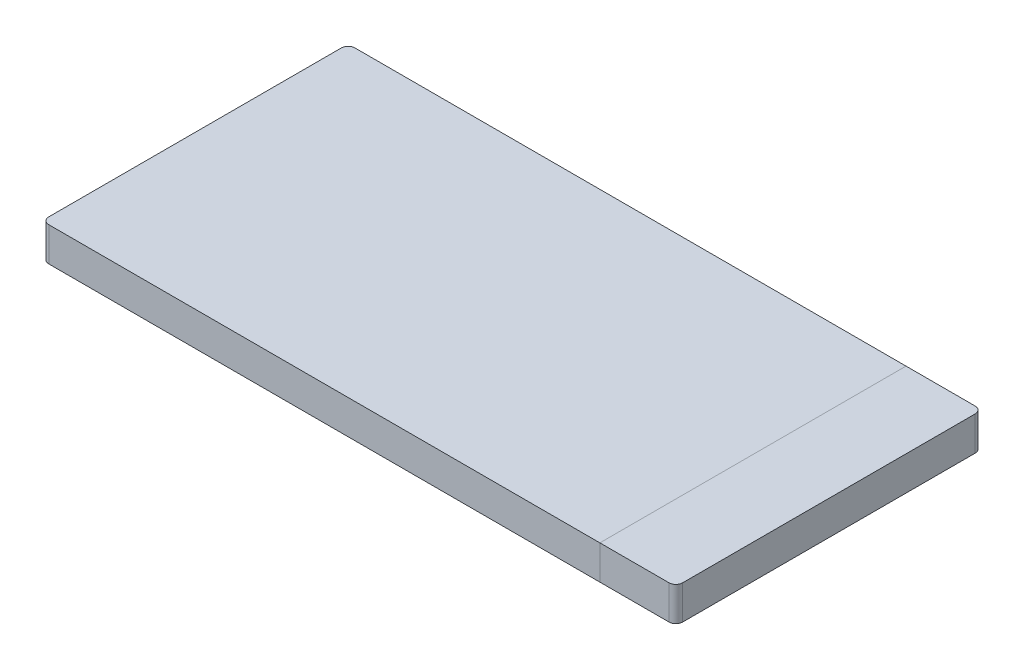
ISO-10303-21;
HEADER;
FILE_DESCRIPTION(('STEP AP214'),'2;1');
FILE_NAME('part.step','',(''),(''),'','','');
FILE_SCHEMA(('AUTOMOTIVE_DESIGN { 1 0 10303 214 1 1 1 1 }'));
ENDSEC;
DATA;
#1=APPLICATION_CONTEXT('core data for automotive mechanical design processes');
#2=APPLICATION_PROTOCOL_DEFINITION('international standard','automotive_design',2000,#1);
#3=PRODUCT_CONTEXT('',#1,'mechanical');
#4=PRODUCT('Part','Part','',(#3));
#5=PRODUCT_RELATED_PRODUCT_CATEGORY('part','',(#4));
#6=PRODUCT_DEFINITION_FORMATION('','',#4);
#7=PRODUCT_DEFINITION_CONTEXT('part definition',#1,'design');
#8=PRODUCT_DEFINITION('design','',#6,#7);
#9=PRODUCT_DEFINITION_SHAPE('','',#8);
#10=(LENGTH_UNIT() NAMED_UNIT(*) SI_UNIT(.MILLI.,.METRE.));
#11=(NAMED_UNIT(*) PLANE_ANGLE_UNIT() SI_UNIT($,.RADIAN.));
#12=(NAMED_UNIT(*) SI_UNIT($,.STERADIAN.) SOLID_ANGLE_UNIT());
#13=UNCERTAINTY_MEASURE_WITH_UNIT(LENGTH_MEASURE(1.E-05),#10,'distance_accuracy_value','');
#14=(GEOMETRIC_REPRESENTATION_CONTEXT(3) GLOBAL_UNCERTAINTY_ASSIGNED_CONTEXT((#13)) GLOBAL_UNIT_ASSIGNED_CONTEXT((#10,
#11,#12)) REPRESENTATION_CONTEXT('',''));
#15=CARTESIAN_POINT('',(0.,0.,0.));
#16=DIRECTION('',(0.,0.,1.));
#17=DIRECTION('',(1.,0.,0.));
#18=AXIS2_PLACEMENT_3D('',#15,#16,#17);
#19=CARTESIAN_POINT('',(0.,1.5,-6.75));
#20=DIRECTION('',(0.,0.,-1.));
#21=DIRECTION('',(-1.,0.,0.));
#22=AXIS2_PLACEMENT_3D('',#19,#20,#21);
#23=PLANE('',#22);
#24=DIRECTION('',(1.,0.,0.));
#25=VECTOR('',#24,1.);
#26=CARTESIAN_POINT('',(0.,1.5,-6.75));
#27=LINE('',#26,#25);
#28=CARTESIAN_POINT('',(10.625,1.5,-6.75));
#29=VERTEX_POINT('',#28);
#30=CARTESIAN_POINT('',(13.675,1.5,-6.75));
#31=VERTEX_POINT('',#30);
#32=EDGE_CURVE('E109',#29,#31,#27,.T.);
#33=ORIENTED_EDGE('',*,*,#32,.T.);
#34=DIRECTION('',(0.,-1.,0.));
#35=VECTOR('',#34,1.);
#36=CARTESIAN_POINT('',(13.675,1.5,-6.75));
#37=LINE('',#36,#35);
#38=CARTESIAN_POINT('',(13.675,0.,-6.75));
#39=VERTEX_POINT('',#38);
#40=EDGE_CURVE('E116',#31,#39,#37,.T.);
#41=ORIENTED_EDGE('',*,*,#40,.T.);
#42=DIRECTION('',(1.,0.,0.));
#43=VECTOR('',#42,1.);
#44=CARTESIAN_POINT('',(0.,0.,-6.75));
#45=LINE('',#44,#43);
#46=CARTESIAN_POINT('',(10.625,0.,-6.75));
#47=VERTEX_POINT('',#46);
#48=EDGE_CURVE('E112',#47,#39,#45,.T.);
#49=ORIENTED_EDGE('',*,*,#48,.F.);
#50=DIRECTION('',(0.,-1.,0.));
#51=VECTOR('',#50,1.);
#52=CARTESIAN_POINT('',(10.625,1.5,-6.75));
#53=LINE('',#52,#51);
#54=EDGE_CURVE('E105',#29,#47,#53,.T.);
#55=ORIENTED_EDGE('',*,*,#54,.F.);
#56=EDGE_LOOP('',(#33,#41,#49,#55));
#57=FACE_BOUND('',#56,.T.);
#58=ADVANCED_FACE('F50',(#57),#23,.T.);
#59=CARTESIAN_POINT('',(10.625,1.5,0.));
#60=DIRECTION('',(1.,0.,0.));
#61=DIRECTION('',(0.,0.,-1.));
#62=AXIS2_PLACEMENT_3D('',#59,#60,#61);
#63=PLANE('',#62);
#64=DIRECTION('',(0.,0.,1.));
#65=VECTOR('',#64,1.);
#66=CARTESIAN_POINT('',(10.625,0.,0.));
#67=LINE('',#66,#65);
#68=CARTESIAN_POINT('',(10.625,0.,6.75));
#69=VERTEX_POINT('',#68);
#70=EDGE_CURVE('E144',#47,#69,#67,.T.);
#71=ORIENTED_EDGE('',*,*,#70,.T.);
#72=DIRECTION('',(0.,-1.,0.));
#73=VECTOR('',#72,1.);
#74=CARTESIAN_POINT('',(10.625,1.5,6.75));
#75=LINE('',#74,#73);
#76=CARTESIAN_POINT('',(10.625,1.5,6.75));
#77=VERTEX_POINT('',#76);
#78=EDGE_CURVE('E117',#77,#69,#75,.T.);
#79=ORIENTED_EDGE('',*,*,#78,.F.);
#80=DIRECTION('',(0.,0.,1.));
#81=VECTOR('',#80,1.);
#82=CARTESIAN_POINT('',(10.625,1.5,0.));
#83=LINE('',#82,#81);
#84=EDGE_CURVE('E120',#29,#77,#83,.T.);
#85=ORIENTED_EDGE('',*,*,#84,.F.);
#86=ORIENTED_EDGE('',*,*,#54,.T.);
#87=EDGE_LOOP('',(#71,#79,#85,#86));
#88=FACE_BOUND('',#87,.T.);
#89=ADVANCED_FACE('F121',(#88),#63,.F.);
#90=CARTESIAN_POINT('',(0.,1.5,6.75));
#91=DIRECTION('',(0.,0.,-1.));
#92=DIRECTION('',(-1.,0.,0.));
#93=AXIS2_PLACEMENT_3D('',#90,#91,#92);
#94=PLANE('',#93);
#95=DIRECTION('',(1.,0.,0.));
#96=VECTOR('',#95,1.);
#97=CARTESIAN_POINT('',(0.,0.,6.75));
#98=LINE('',#97,#96);
#99=CARTESIAN_POINT('',(13.675,0.,6.75));
#100=VERTEX_POINT('',#99);
#101=EDGE_CURVE('E134',#69,#100,#98,.T.);
#102=ORIENTED_EDGE('',*,*,#101,.T.);
#103=DIRECTION('',(0.,-1.,0.));
#104=VECTOR('',#103,1.);
#105=CARTESIAN_POINT('',(13.675,1.5,6.75));
#106=LINE('',#105,#104);
#107=CARTESIAN_POINT('',(13.675,1.5,6.75));
#108=VERTEX_POINT('',#107);
#109=EDGE_CURVE('E12',#100,#108,#106,.F.);
#110=ORIENTED_EDGE('',*,*,#109,.T.);
#111=DIRECTION('',(1.,0.,0.));
#112=VECTOR('',#111,1.);
#113=CARTESIAN_POINT('',(0.,1.5,6.75));
#114=LINE('',#113,#112);
#115=EDGE_CURVE('E124',#77,#108,#114,.T.);
#116=ORIENTED_EDGE('',*,*,#115,.F.);
#117=ORIENTED_EDGE('',*,*,#78,.T.);
#118=EDGE_LOOP('',(#102,#110,#116,#117));
#119=FACE_BOUND('',#118,.T.);
#120=ADVANCED_FACE('F177',(#119),#94,.F.);
#121=CARTESIAN_POINT('',(13.975,1.5,0.));
#122=DIRECTION('',(1.,0.,0.));
#123=DIRECTION('',(0.,0.,-1.));
#124=AXIS2_PLACEMENT_3D('',#121,#122,#123);
#125=PLANE('',#124);
#126=DIRECTION('',(0.,0.,1.));
#127=VECTOR('',#126,1.);
#128=CARTESIAN_POINT('',(13.975,0.,0.));
#129=LINE('',#128,#127);
#130=CARTESIAN_POINT('',(13.975,0.,-6.45));
#131=VERTEX_POINT('',#130);
#132=CARTESIAN_POINT('',(13.975,0.,6.45));
#133=VERTEX_POINT('',#132);
#134=EDGE_CURVE('E129',#131,#133,#129,.T.);
#135=ORIENTED_EDGE('',*,*,#134,.F.);
#136=DIRECTION('',(0.,-1.,0.));
#137=VECTOR('',#136,1.);
#138=CARTESIAN_POINT('',(13.975,1.5,-6.45));
#139=LINE('',#138,#137);
#140=CARTESIAN_POINT('',(13.975,1.5,-6.45));
#141=VERTEX_POINT('',#140);
#142=EDGE_CURVE('E162',#131,#141,#139,.F.);
#143=ORIENTED_EDGE('',*,*,#142,.T.);
#144=DIRECTION('',(0.,0.,1.));
#145=VECTOR('',#144,1.);
#146=CARTESIAN_POINT('',(13.975,1.5,0.));
#147=LINE('',#146,#145);
#148=CARTESIAN_POINT('',(13.975,1.5,6.45));
#149=VERTEX_POINT('',#148);
#150=EDGE_CURVE('E139',#141,#149,#147,.T.);
#151=ORIENTED_EDGE('',*,*,#150,.T.);
#152=DIRECTION('',(0.,-1.,0.));
#153=VECTOR('',#152,1.);
#154=CARTESIAN_POINT('',(13.975,0.,6.45));
#155=LINE('',#154,#153);
#156=EDGE_CURVE('E158',#149,#133,#155,.T.);
#157=ORIENTED_EDGE('',*,*,#156,.T.);
#158=EDGE_LOOP('',(#135,#143,#151,#157));
#159=FACE_BOUND('',#158,.T.);
#160=ADVANCED_FACE('F170',(#159),#125,.T.);
#161=CARTESIAN_POINT('',(0.,1.5,0.));
#162=DIRECTION('',(0.,1.,0.));
#163=DIRECTION('',(0.,0.,1.));
#164=AXIS2_PLACEMENT_3D('',#161,#162,#163);
#165=PLANE('',#164);
#166=ORIENTED_EDGE('',*,*,#150,.F.);
#167=CARTESIAN_POINT('',(13.675,1.5,-6.45));
#168=DIRECTION('',(0.,1.,0.));
#169=DIRECTION('',(0.,0.,1.));
#170=AXIS2_PLACEMENT_3D('',#167,#168,#169);
#171=CIRCLE('',#170,0.3);
#172=EDGE_CURVE('E59',#141,#31,#171,.T.);
#173=ORIENTED_EDGE('',*,*,#172,.T.);
#174=ORIENTED_EDGE('',*,*,#32,.F.);
#175=ORIENTED_EDGE('',*,*,#84,.T.);
#176=ORIENTED_EDGE('',*,*,#115,.T.);
#177=CARTESIAN_POINT('',(13.675,1.5,6.45));
#178=DIRECTION('',(0.,1.,0.));
#179=DIRECTION('',(0.,0.,1.));
#180=AXIS2_PLACEMENT_3D('',#177,#178,#179);
#181=CIRCLE('',#180,0.3);
#182=EDGE_CURVE('E71',#108,#149,#181,.T.);
#183=ORIENTED_EDGE('',*,*,#182,.T.);
#184=EDGE_LOOP('',(#166,#173,#174,#175,#176,#183));
#185=FACE_BOUND('',#184,.T.);
#186=ADVANCED_FACE('F126',(#185),#165,.T.);
#187=CARTESIAN_POINT('',(0.,0.,0.));
#188=DIRECTION('',(0.,1.,0.));
#189=DIRECTION('',(0.,0.,1.));
#190=AXIS2_PLACEMENT_3D('',#187,#188,#189);
#191=PLANE('',#190);
#192=ORIENTED_EDGE('',*,*,#48,.T.);
#193=CARTESIAN_POINT('',(13.675,0.,-6.45));
#194=DIRECTION('',(0.,1.,0.));
#195=DIRECTION('',(0.,0.,1.));
#196=AXIS2_PLACEMENT_3D('',#193,#194,#195);
#197=CIRCLE('',#196,0.3);
#198=EDGE_CURVE('E155',#39,#131,#197,.F.);
#199=ORIENTED_EDGE('',*,*,#198,.T.);
#200=ORIENTED_EDGE('',*,*,#134,.T.);
#201=CARTESIAN_POINT('',(13.675,0.,6.45));
#202=DIRECTION('',(0.,1.,0.));
#203=DIRECTION('',(0.,0.,1.));
#204=AXIS2_PLACEMENT_3D('',#201,#202,#203);
#205=CIRCLE('',#204,0.3);
#206=EDGE_CURVE('E152',#133,#100,#205,.F.);
#207=ORIENTED_EDGE('',*,*,#206,.T.);
#208=ORIENTED_EDGE('',*,*,#101,.F.);
#209=ORIENTED_EDGE('',*,*,#70,.F.);
#210=EDGE_LOOP('',(#192,#199,#200,#207,#208,#209));
#211=FACE_BOUND('',#210,.T.);
#212=ADVANCED_FACE('F175',(#211),#191,.F.);
#213=CARTESIAN_POINT('',(13.675,1.5,-6.45));
#214=DIRECTION('',(0.,-1.,0.));
#215=DIRECTION('',(0.,0.,-1.));
#216=AXIS2_PLACEMENT_3D('',#213,#214,#215);
#217=CYLINDRICAL_SURFACE('',#216,0.3);
#218=ORIENTED_EDGE('',*,*,#172,.F.);
#219=ORIENTED_EDGE('',*,*,#142,.F.);
#220=ORIENTED_EDGE('',*,*,#198,.F.);
#221=ORIENTED_EDGE('',*,*,#40,.F.);
#222=EDGE_LOOP('',(#218,#219,#220,#221));
#223=FACE_BOUND('',#222,.T.);
#224=ADVANCED_FACE('F173',(#223),#217,.T.);
#225=CARTESIAN_POINT('',(13.675,1.5,6.45));
#226=DIRECTION('',(0.,1.,0.));
#227=DIRECTION('',(0.,0.,1.));
#228=AXIS2_PLACEMENT_3D('',#225,#226,#227);
#229=CYLINDRICAL_SURFACE('',#228,0.3);
#230=ORIENTED_EDGE('',*,*,#182,.F.);
#231=ORIENTED_EDGE('',*,*,#109,.F.);
#232=ORIENTED_EDGE('',*,*,#206,.F.);
#233=ORIENTED_EDGE('',*,*,#156,.F.);
#234=EDGE_LOOP('',(#230,#231,#232,#233));
#235=FACE_BOUND('',#234,.T.);
#236=ADVANCED_FACE('F52',(#235),#229,.T.);
#237=CLOSED_SHELL('',(#58,#89,#120,#160,#186,#212,#224,#236));
#238=MANIFOLD_SOLID_BREP('B2',#237);
#239=CARTESIAN_POINT('',(10.625,1.5,0.));
#240=DIRECTION('',(1.,0.,0.));
#241=DIRECTION('',(0.,0.,-1.));
#242=AXIS2_PLACEMENT_3D('',#239,#240,#241);
#243=PLANE('',#242);
#244=DIRECTION('',(0.,0.,1.));
#245=VECTOR('',#244,1.);
#246=CARTESIAN_POINT('',(10.625,0.,0.));
#247=LINE('',#246,#245);
#248=CARTESIAN_POINT('',(10.625,0.,-6.75));
#249=VERTEX_POINT('',#248);
#250=CARTESIAN_POINT('',(10.625,0.,6.75));
#251=VERTEX_POINT('',#250);
#252=EDGE_CURVE('E340',#249,#251,#247,.T.);
#253=ORIENTED_EDGE('',*,*,#252,.F.);
#254=DIRECTION('',(0.,-1.,0.));
#255=VECTOR('',#254,1.);
#256=CARTESIAN_POINT('',(10.625,1.5,-6.75));
#257=LINE('',#256,#255);
#258=CARTESIAN_POINT('',(10.625,1.5,-6.75));
#259=VERTEX_POINT('',#258);
#260=EDGE_CURVE('E328',#259,#249,#257,.T.);
#261=ORIENTED_EDGE('',*,*,#260,.F.);
#262=DIRECTION('',(0.,0.,1.));
#263=VECTOR('',#262,1.);
#264=CARTESIAN_POINT('',(10.625,1.5,0.));
#265=LINE('',#264,#263);
#266=CARTESIAN_POINT('',(10.625,1.5,6.75));
#267=VERTEX_POINT('',#266);
#268=EDGE_CURVE('E334',#259,#267,#265,.T.);
#269=ORIENTED_EDGE('',*,*,#268,.T.);
#270=DIRECTION('',(0.,-1.,0.));
#271=VECTOR('',#270,1.);
#272=CARTESIAN_POINT('',(10.625,1.5,6.75));
#273=LINE('',#272,#271);
#274=EDGE_CURVE('E343',#267,#251,#273,.T.);
#275=ORIENTED_EDGE('',*,*,#274,.T.);
#276=EDGE_LOOP('',(#253,#261,#269,#275));
#277=FACE_BOUND('',#276,.T.);
#278=ADVANCED_FACE('F271',(#277),#243,.T.);
#279=CARTESIAN_POINT('',(0.,1.5,-6.75));
#280=DIRECTION('',(0.,0.,-1.));
#281=DIRECTION('',(-1.,0.,0.));
#282=AXIS2_PLACEMENT_3D('',#279,#280,#281);
#283=PLANE('',#282);
#284=DIRECTION('',(1.,0.,0.));
#285=VECTOR('',#284,1.);
#286=CARTESIAN_POINT('',(0.,0.,-6.75));
#287=LINE('',#286,#285);
#288=CARTESIAN_POINT('',(-13.675,0.,-6.75));
#289=VERTEX_POINT('',#288);
#290=EDGE_CURVE('E362',#289,#249,#287,.T.);
#291=ORIENTED_EDGE('',*,*,#290,.F.);
#292=DIRECTION('',(0.,-1.,0.));
#293=VECTOR('',#292,1.);
#294=CARTESIAN_POINT('',(-13.675,1.5,-6.75));
#295=LINE('',#294,#293);
#296=CARTESIAN_POINT('',(-13.675,1.5,-6.75));
#297=VERTEX_POINT('',#296);
#298=EDGE_CURVE('E295',#289,#297,#295,.F.);
#299=ORIENTED_EDGE('',*,*,#298,.T.);
#300=DIRECTION('',(1.,0.,0.));
#301=VECTOR('',#300,1.);
#302=CARTESIAN_POINT('',(0.,1.5,-6.75));
#303=LINE('',#302,#301);
#304=EDGE_CURVE('E325',#297,#259,#303,.T.);
#305=ORIENTED_EDGE('',*,*,#304,.T.);
#306=ORIENTED_EDGE('',*,*,#260,.T.);
#307=EDGE_LOOP('',(#291,#299,#305,#306));
#308=FACE_BOUND('',#307,.T.);
#309=ADVANCED_FACE('F327',(#308),#283,.T.);
#310=CARTESIAN_POINT('',(-13.975,1.5,0.));
#311=DIRECTION('',(1.,0.,0.));
#312=DIRECTION('',(0.,0.,-1.));
#313=AXIS2_PLACEMENT_3D('',#310,#311,#312);
#314=PLANE('',#313);
#315=DIRECTION('',(0.,0.,1.));
#316=VECTOR('',#315,1.);
#317=CARTESIAN_POINT('',(-13.975,1.5,0.));
#318=LINE('',#317,#316);
#319=CARTESIAN_POINT('',(-13.975,1.5,-6.45));
#320=VERTEX_POINT('',#319);
#321=CARTESIAN_POINT('',(-13.975,1.5,6.45));
#322=VERTEX_POINT('',#321);
#323=EDGE_CURVE('E333',#320,#322,#318,.T.);
#324=ORIENTED_EDGE('',*,*,#323,.F.);
#325=DIRECTION('',(0.,-1.,0.));
#326=VECTOR('',#325,1.);
#327=CARTESIAN_POINT('',(-13.975,0.,-6.45));
#328=LINE('',#327,#326);
#329=CARTESIAN_POINT('',(-13.975,0.,-6.45));
#330=VERTEX_POINT('',#329);
#331=EDGE_CURVE('E371',#320,#330,#328,.T.);
#332=ORIENTED_EDGE('',*,*,#331,.T.);
#333=DIRECTION('',(0.,0.,1.));
#334=VECTOR('',#333,1.);
#335=CARTESIAN_POINT('',(-13.975,0.,0.));
#336=LINE('',#335,#334);
#337=CARTESIAN_POINT('',(-13.975,0.,6.45));
#338=VERTEX_POINT('',#337);
#339=EDGE_CURVE('E353',#330,#338,#336,.T.);
#340=ORIENTED_EDGE('',*,*,#339,.T.);
#341=DIRECTION('',(0.,-1.,0.));
#342=VECTOR('',#341,1.);
#343=CARTESIAN_POINT('',(-13.975,1.5,6.45));
#344=LINE('',#343,#342);
#345=EDGE_CURVE('E342',#338,#322,#344,.F.);
#346=ORIENTED_EDGE('',*,*,#345,.T.);
#347=EDGE_LOOP('',(#324,#332,#340,#346));
#348=FACE_BOUND('',#347,.T.);
#349=ADVANCED_FACE('F389',(#348),#314,.F.);
#350=CARTESIAN_POINT('',(0.,1.5,6.75));
#351=DIRECTION('',(0.,0.,-1.));
#352=DIRECTION('',(-1.,0.,0.));
#353=AXIS2_PLACEMENT_3D('',#350,#351,#352);
#354=PLANE('',#353);
#355=DIRECTION('',(1.,0.,0.));
#356=VECTOR('',#355,1.);
#357=CARTESIAN_POINT('',(0.,1.5,6.75));
#358=LINE('',#357,#356);
#359=CARTESIAN_POINT('',(-13.675,1.5,6.75));
#360=VERTEX_POINT('',#359);
#361=EDGE_CURVE('E346',#360,#267,#358,.T.);
#362=ORIENTED_EDGE('',*,*,#361,.F.);
#363=DIRECTION('',(0.,-1.,0.));
#364=VECTOR('',#363,1.);
#365=CARTESIAN_POINT('',(-13.675,1.5,6.75));
#366=LINE('',#365,#364);
#367=CARTESIAN_POINT('',(-13.675,0.,6.75));
#368=VERTEX_POINT('',#367);
#369=EDGE_CURVE('E48',#360,#368,#366,.T.);
#370=ORIENTED_EDGE('',*,*,#369,.T.);
#371=DIRECTION('',(1.,0.,0.));
#372=VECTOR('',#371,1.);
#373=CARTESIAN_POINT('',(0.,0.,6.75));
#374=LINE('',#373,#372);
#375=EDGE_CURVE('E349',#368,#251,#374,.T.);
#376=ORIENTED_EDGE('',*,*,#375,.T.);
#377=ORIENTED_EDGE('',*,*,#274,.F.);
#378=EDGE_LOOP('',(#362,#370,#376,#377));
#379=FACE_BOUND('',#378,.T.);
#380=ADVANCED_FACE('F399',(#379),#354,.F.);
#381=CARTESIAN_POINT('',(0.,1.5,0.));
#382=DIRECTION('',(0.,1.,0.));
#383=DIRECTION('',(0.,0.,1.));
#384=AXIS2_PLACEMENT_3D('',#381,#382,#383);
#385=PLANE('',#384);
#386=ORIENTED_EDGE('',*,*,#304,.F.);
#387=CARTESIAN_POINT('',(-13.675,1.5,-6.45));
#388=DIRECTION('',(0.,1.,0.));
#389=DIRECTION('',(0.,0.,1.));
#390=AXIS2_PLACEMENT_3D('',#387,#388,#389);
#391=CIRCLE('',#390,0.3);
#392=EDGE_CURVE('E280',#297,#320,#391,.T.);
#393=ORIENTED_EDGE('',*,*,#392,.T.);
#394=ORIENTED_EDGE('',*,*,#323,.T.);
#395=CARTESIAN_POINT('',(-13.675,1.5,6.45));
#396=DIRECTION('',(0.,1.,0.));
#397=DIRECTION('',(0.,0.,1.));
#398=AXIS2_PLACEMENT_3D('',#395,#396,#397);
#399=CIRCLE('',#398,0.3);
#400=EDGE_CURVE('E287',#322,#360,#399,.T.);
#401=ORIENTED_EDGE('',*,*,#400,.T.);
#402=ORIENTED_EDGE('',*,*,#361,.T.);
#403=ORIENTED_EDGE('',*,*,#268,.F.);
#404=EDGE_LOOP('',(#386,#393,#394,#401,#402,#403));
#405=FACE_BOUND('',#404,.T.);
#406=ADVANCED_FACE('F345',(#405),#385,.T.);
#407=CARTESIAN_POINT('',(0.,0.,0.));
#408=DIRECTION('',(0.,1.,0.));
#409=DIRECTION('',(0.,0.,1.));
#410=AXIS2_PLACEMENT_3D('',#407,#408,#409);
#411=PLANE('',#410);
#412=ORIENTED_EDGE('',*,*,#339,.F.);
#413=CARTESIAN_POINT('',(-13.675,0.,-6.45));
#414=DIRECTION('',(0.,1.,0.));
#415=DIRECTION('',(0.,0.,1.));
#416=AXIS2_PLACEMENT_3D('',#413,#414,#415);
#417=CIRCLE('',#416,0.3);
#418=EDGE_CURVE('E378',#330,#289,#417,.F.);
#419=ORIENTED_EDGE('',*,*,#418,.T.);
#420=ORIENTED_EDGE('',*,*,#290,.T.);
#421=ORIENTED_EDGE('',*,*,#252,.T.);
#422=ORIENTED_EDGE('',*,*,#375,.F.);
#423=CARTESIAN_POINT('',(-13.675,0.,6.45));
#424=DIRECTION('',(0.,1.,0.));
#425=DIRECTION('',(0.,0.,1.));
#426=AXIS2_PLACEMENT_3D('',#423,#424,#425);
#427=CIRCLE('',#426,0.3);
#428=EDGE_CURVE('E375',#368,#338,#427,.F.);
#429=ORIENTED_EDGE('',*,*,#428,.T.);
#430=EDGE_LOOP('',(#412,#419,#420,#421,#422,#429));
#431=FACE_BOUND('',#430,.T.);
#432=ADVANCED_FACE('F394',(#431),#411,.F.);
#433=CARTESIAN_POINT('',(-13.675,1.5,-6.45));
#434=DIRECTION('',(0.,1.,0.));
#435=DIRECTION('',(0.,0.,1.));
#436=AXIS2_PLACEMENT_3D('',#433,#434,#435);
#437=CYLINDRICAL_SURFACE('',#436,0.3);
#438=ORIENTED_EDGE('',*,*,#392,.F.);
#439=ORIENTED_EDGE('',*,*,#298,.F.);
#440=ORIENTED_EDGE('',*,*,#418,.F.);
#441=ORIENTED_EDGE('',*,*,#331,.F.);
#442=EDGE_LOOP('',(#438,#439,#440,#441));
#443=FACE_BOUND('',#442,.T.);
#444=ADVANCED_FACE('F392',(#443),#437,.T.);
#445=CARTESIAN_POINT('',(-13.675,1.5,6.45));
#446=DIRECTION('',(0.,-1.,0.));
#447=DIRECTION('',(0.,0.,-1.));
#448=AXIS2_PLACEMENT_3D('',#445,#446,#447);
#449=CYLINDRICAL_SURFACE('',#448,0.3);
#450=ORIENTED_EDGE('',*,*,#400,.F.);
#451=ORIENTED_EDGE('',*,*,#345,.F.);
#452=ORIENTED_EDGE('',*,*,#428,.F.);
#453=ORIENTED_EDGE('',*,*,#369,.F.);
#454=EDGE_LOOP('',(#450,#451,#452,#453));
#455=FACE_BOUND('',#454,.T.);
#456=ADVANCED_FACE('F273',(#455),#449,.T.);
#457=CLOSED_SHELL('',(#278,#309,#349,#380,#406,#432,#444,#456));
#458=MANIFOLD_SOLID_BREP('B6',#457);
#459=ADVANCED_BREP_SHAPE_REPRESENTATION('',(#18,#238,#458),#14);
#460=SHAPE_DEFINITION_REPRESENTATION(#9,#459);
ENDSEC;
END-ISO-10303-21;
